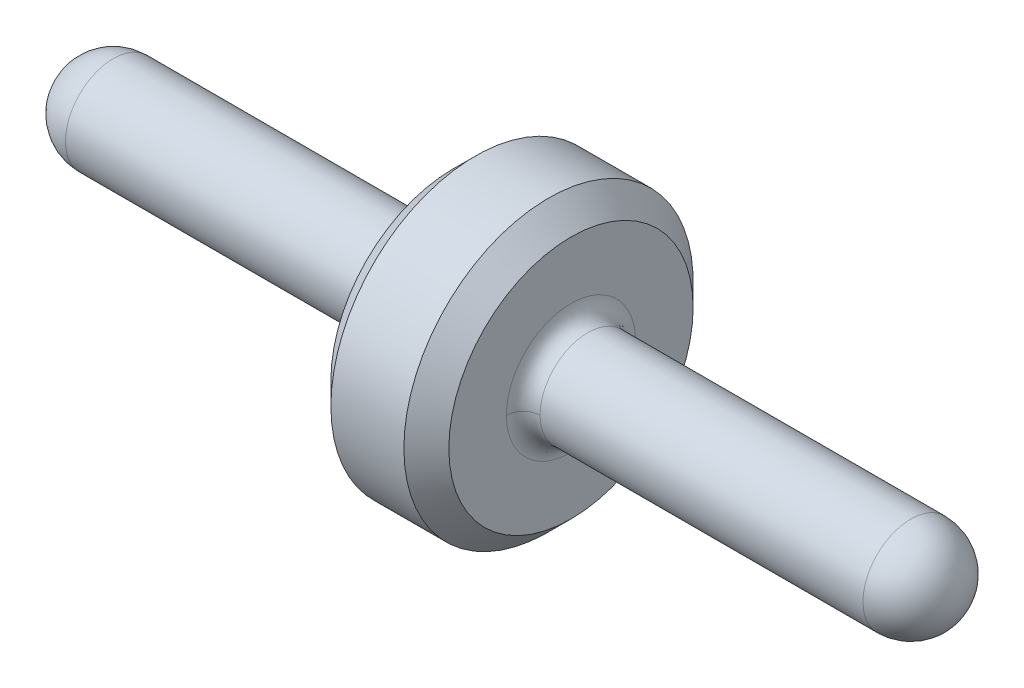
ISO-10303-21;
HEADER;
FILE_DESCRIPTION(('STEP AP214'),'2;1');
FILE_NAME('part.step','',(''),(''),'','','');
FILE_SCHEMA(('AUTOMOTIVE_DESIGN { 1 0 10303 214 1 1 1 1 }'));
ENDSEC;
DATA;
#1=APPLICATION_CONTEXT('core data for automotive mechanical design processes');
#2=APPLICATION_PROTOCOL_DEFINITION('international standard','automotive_design',2000,#1);
#3=PRODUCT_CONTEXT('',#1,'mechanical');
#4=PRODUCT('Part','Part','',(#3));
#5=PRODUCT_RELATED_PRODUCT_CATEGORY('part','',(#4));
#6=PRODUCT_DEFINITION_FORMATION('','',#4);
#7=PRODUCT_DEFINITION_CONTEXT('part definition',#1,'design');
#8=PRODUCT_DEFINITION('design','',#6,#7);
#9=PRODUCT_DEFINITION_SHAPE('','',#8);
#10=(LENGTH_UNIT() NAMED_UNIT(*) SI_UNIT(.MILLI.,.METRE.));
#11=(NAMED_UNIT(*) PLANE_ANGLE_UNIT() SI_UNIT($,.RADIAN.));
#12=(NAMED_UNIT(*) SI_UNIT($,.STERADIAN.) SOLID_ANGLE_UNIT());
#13=UNCERTAINTY_MEASURE_WITH_UNIT(LENGTH_MEASURE(1.E-05),#10,'distance_accuracy_value','');
#14=(GEOMETRIC_REPRESENTATION_CONTEXT(3) GLOBAL_UNCERTAINTY_ASSIGNED_CONTEXT((#13)) GLOBAL_UNIT_ASSIGNED_CONTEXT((#10,
#11,#12)) REPRESENTATION_CONTEXT('',''));
#15=CARTESIAN_POINT('',(0.,0.,0.));
#16=DIRECTION('',(0.,0.,1.));
#17=DIRECTION('',(1.,0.,0.));
#18=AXIS2_PLACEMENT_3D('',#15,#16,#17);
#19=CARTESIAN_POINT('',(3.8227,0.,0.));
#20=DIRECTION('',(-1.,0.,0.));
#21=DIRECTION('',(0.,-1.,0.));
#22=AXIS2_PLACEMENT_3D('',#19,#20,#21);
#23=SPHERICAL_SURFACE('',#22,0.2159);
#24=CARTESIAN_POINT('',(4.0386,2.159E-09,0.));
#25=VERTEX_POINT('',#24);
#26=VERTEX_LOOP('',#25);
#27=FACE_BOUND('',#26,.T.);
#28=CARTESIAN_POINT('',(3.8227,0.,0.));
#29=DIRECTION('',(-1.,0.,0.));
#30=DIRECTION('',(0.,0.,1.));
#31=AXIS2_PLACEMENT_3D('',#28,#29,#30);
#32=CIRCLE('',#31,0.2159);
#33=CARTESIAN_POINT('',(3.8227,0.,0.2159));
#34=VERTEX_POINT('',#33);
#35=EDGE_CURVE('E87',#34,#34,#32,.F.);
#36=ORIENTED_EDGE('',*,*,#35,.T.);
#37=EDGE_LOOP('',(#36));
#38=FACE_BOUND('',#37,.T.);
#39=ADVANCED_FACE('F17',(#27,#38),#23,.T.);
#40=CARTESIAN_POINT('',(3.8227,0.,0.));
#41=DIRECTION('',(-1.,0.,0.));
#42=DIRECTION('',(0.,0.,1.));
#43=AXIS2_PLACEMENT_3D('',#40,#41,#42);
#44=CYLINDRICAL_SURFACE('',#43,0.2159);
#45=CARTESIAN_POINT('',(2.3622,0.,0.));
#46=DIRECTION('',(-1.,0.,0.));
#47=DIRECTION('',(0.,0.,1.));
#48=AXIS2_PLACEMENT_3D('',#45,#46,#47);
#49=CIRCLE('',#48,0.2159);
#50=CARTESIAN_POINT('',(2.36219999777847,-4.428183021646E-11,-0.215900005892549));
#51=VERTEX_POINT('',#50);
#52=CARTESIAN_POINT('',(2.3622,-1.93864443777635E-11,0.2159));
#53=VERTEX_POINT('',#52);
#54=EDGE_CURVE('E22',#51,#53,#49,.F.);
#55=ORIENTED_EDGE('',*,*,#54,.T.);
#56=CARTESIAN_POINT('',(2.3622,0.,0.));
#57=DIRECTION('',(-1.,0.,0.));
#58=DIRECTION('',(0.,0.,1.));
#59=AXIS2_PLACEMENT_3D('',#56,#57,#58);
#60=CIRCLE('',#59,0.2159);
#61=EDGE_CURVE('E75',#51,#53,#60,.T.);
#62=ORIENTED_EDGE('',*,*,#61,.F.);
#63=EDGE_LOOP('',(#55,#62));
#64=FACE_BOUND('',#63,.T.);
#65=ORIENTED_EDGE('',*,*,#35,.F.);
#66=EDGE_LOOP('',(#65));
#67=FACE_BOUND('',#66,.T.);
#68=ADVANCED_FACE('F89',(#64,#67),#44,.T.);
#69=CARTESIAN_POINT('',(2.3698073,0.,-0.2162806952));
#70=CARTESIAN_POINT('',(2.3698073,-0.432561365,-0.2162806952));
#71=CARTESIAN_POINT('',(2.3698073,-0.432561365,0.2162806952));
#72=CARTESIAN_POINT('',(2.3698073,0.,0.2162806952));
#73=CARTESIAN_POINT('',(2.3179999106,0.,-0.2110826106));
#74=CARTESIAN_POINT('',(2.3179999106,-0.4221651958,-0.2110826106));
#75=CARTESIAN_POINT('',(2.3179999106,-0.4221651958,0.2110826106));
#76=CARTESIAN_POINT('',(2.3179999106,0.,0.2110826106));
#77=CARTESIAN_POINT('',(2.2811826106,0.,-0.2478999106));
#78=CARTESIAN_POINT('',(2.2811826106,-0.4957997958,-0.2478999106));
#79=CARTESIAN_POINT('',(2.2811826106,-0.4957997958,0.2478999106));
#80=CARTESIAN_POINT('',(2.2811826106,0.,0.2478999106));
#81=CARTESIAN_POINT('',(2.2863806952,0.,-0.2997073));
#82=CARTESIAN_POINT('',(2.2863806952,-0.5994146,-0.2997073));
#83=CARTESIAN_POINT('',(2.2863806952,-0.5994146,0.2997073));
#84=CARTESIAN_POINT('',(2.2863806952,0.,0.2997073));
#85=(BOUNDED_SURFACE() B_SPLINE_SURFACE(3,3,((#69,#70,#71,#72),(#73,#74,#75,#76),(#77,#78,#79,
#80),(#81,#82,#83,#84)),.UNSPECIFIED.,.F.,.F.,.F.) B_SPLINE_SURFACE_WITH_KNOTS((4,4),(4,4),(0.,
1.),(0.,1.),.UNSPECIFIED.) GEOMETRIC_REPRESENTATION_ITEM() RATIONAL_B_SPLINE_SURFACE(((1.,
0.333333333333333,0.333333333333333,1.),(0.755320871117973,0.251773623705991,0.251773623705991,
0.755320871117973),(0.755320871117973,0.251773623705991,0.251773623705991,0.755320871117973),
(1.,0.333333333333333,0.333333333333333,1.))) REPRESENTATION_ITEM('') SURFACE());
#86=CARTESIAN_POINT('',(2.3698073,0.,-0.2162806952));
#87=CARTESIAN_POINT('',(2.3179999106,0.,-0.2110826106));
#88=CARTESIAN_POINT('',(2.2811826106,0.,-0.2478999106));
#89=CARTESIAN_POINT('',(2.2863806952,0.,-0.2997073));
#90=(BOUNDED_CURVE() B_SPLINE_CURVE(3,(#86,#87,#88,#89),.UNSPECIFIED.,.F.,
.F.) B_SPLINE_CURVE_WITH_KNOTS((4,4),(0.,1.),
.UNSPECIFIED.) CURVE() GEOMETRIC_REPRESENTATION_ITEM() RATIONAL_B_SPLINE_CURVE((1.,
0.755320871117973,0.755320871117973,1.)) REPRESENTATION_ITEM(''));
#91=CARTESIAN_POINT('',(2.28600000707106,0.,-0.29209999924224));
#92=VERTEX_POINT('',#91);
#93=EDGE_CURVE('E84',#92,#51,#90,.F.);
#94=CARTESIAN_POINT('',(2.3698073,0.,0.2162806952));
#95=CARTESIAN_POINT('',(2.3179999106,0.,0.2110826106));
#96=CARTESIAN_POINT('',(2.2811826106,0.,0.2478999106));
#97=CARTESIAN_POINT('',(2.2863806952,0.,0.2997073));
#98=(BOUNDED_CURVE() B_SPLINE_CURVE(3,(#94,#95,#96,#97),.UNSPECIFIED.,.F.,
.F.) B_SPLINE_CURVE_WITH_KNOTS((4,4),(0.,1.),
.UNSPECIFIED.) CURVE() GEOMETRIC_REPRESENTATION_ITEM() RATIONAL_B_SPLINE_CURVE((1.,
0.755320871117973,0.755320871117973,1.)) REPRESENTATION_ITEM(''));
#99=CARTESIAN_POINT('',(2.28600000707106,0.,0.29209999924224));
#100=VERTEX_POINT('',#99);
#101=EDGE_CURVE('E81',#53,#100,#98,.T.);
#102=CARTESIAN_POINT('',(2.2860000117851,0.,0.29210000016356));
#103=CARTESIAN_POINT('',(2.2860000117851,-0.584199996761219,0.29210000016356));
#104=CARTESIAN_POINT('',(2.2860000117851,-0.584199996761219,-0.29210000016356));
#105=CARTESIAN_POINT('',(2.2860000117851,0.,-0.29210000016356));
#106=(BOUNDED_CURVE() B_SPLINE_CURVE(3,(#102,#103,#104,#105),.UNSPECIFIED.,.F.,
.F.) B_SPLINE_CURVE_WITH_KNOTS((4,4),(0.,1.),
.UNSPECIFIED.) CURVE() GEOMETRIC_REPRESENTATION_ITEM() RATIONAL_B_SPLINE_CURVE((0.956578326119741,
0.318859442039913,0.318859442039913,0.956578326119741)) REPRESENTATION_ITEM(''));
#107=EDGE_CURVE('E228',#100,#92,#106,.T.);
#108=ORIENTED_EDGE('',*,*,#93,.T.);
#109=ORIENTED_EDGE('',*,*,#61,.T.);
#110=ORIENTED_EDGE('',*,*,#101,.T.);
#111=ORIENTED_EDGE('',*,*,#107,.T.);
#112=EDGE_LOOP('',(#108,#109,#110,#111));
#113=FACE_BOUND('',#112,.T.);
#114=ADVANCED_FACE('F79',(#113),#85,.F.);
#115=CARTESIAN_POINT('',(2.3698073,0.,0.2162806952));
#116=CARTESIAN_POINT('',(2.3698073,0.432561365,0.2162806952));
#117=CARTESIAN_POINT('',(2.3698073,0.432561365,-0.2162806952));
#118=CARTESIAN_POINT('',(2.3698073,0.,-0.2162806952));
#119=CARTESIAN_POINT('',(2.3179999106,0.,0.2110826106));
#120=CARTESIAN_POINT('',(2.3179999106,0.4221651958,0.2110826106));
#121=CARTESIAN_POINT('',(2.3179999106,0.4221651958,-0.2110826106));
#122=CARTESIAN_POINT('',(2.3179999106,0.,-0.2110826106));
#123=CARTESIAN_POINT('',(2.2811826106,0.,0.2478999106));
#124=CARTESIAN_POINT('',(2.2811826106,0.4957997958,0.2478999106));
#125=CARTESIAN_POINT('',(2.2811826106,0.4957997958,-0.2478999106));
#126=CARTESIAN_POINT('',(2.2811826106,0.,-0.2478999106));
#127=CARTESIAN_POINT('',(2.2863806952,0.,0.2997073));
#128=CARTESIAN_POINT('',(2.2863806952,0.5994146,0.2997073));
#129=CARTESIAN_POINT('',(2.2863806952,0.5994146,-0.2997073));
#130=CARTESIAN_POINT('',(2.2863806952,0.,-0.2997073));
#131=(BOUNDED_SURFACE() B_SPLINE_SURFACE(3,3,((#115,#116,#117,#118),(#119,#120,#121,#122),(#123,
#124,#125,#126),(#127,#128,#129,#130)),.UNSPECIFIED.,.F.,.F.,
.F.) B_SPLINE_SURFACE_WITH_KNOTS((4,4),(4,4),(0.,1.),(0.,1.),
.UNSPECIFIED.) GEOMETRIC_REPRESENTATION_ITEM() RATIONAL_B_SPLINE_SURFACE(((1.,0.333333333333333,
0.333333333333333,1.),(0.755320871117973,0.251773623705991,0.251773623705991,0.755320871117973),
(0.755320871117973,0.251773623705991,0.251773623705991,0.755320871117973),(1.,0.333333333333333,
0.333333333333333,1.))) REPRESENTATION_ITEM('') SURFACE());
#132=CARTESIAN_POINT('',(2.2860000117851,0.,-0.292100000163559));
#133=CARTESIAN_POINT('',(2.2860000117851,0.584199996761219,-0.29210000016356));
#134=CARTESIAN_POINT('',(2.2860000117851,0.584199996761219,0.29210000016356));
#135=CARTESIAN_POINT('',(2.2860000117851,0.,0.292100000163559));
#136=(BOUNDED_CURVE() B_SPLINE_CURVE(3,(#132,#133,#134,#135),.UNSPECIFIED.,.F.,
.F.) B_SPLINE_CURVE_WITH_KNOTS((4,4),(0.,1.),
.UNSPECIFIED.) CURVE() GEOMETRIC_REPRESENTATION_ITEM() RATIONAL_B_SPLINE_CURVE((0.95657832611974,
0.318859442039913,0.318859442039913,0.95657832611974)) REPRESENTATION_ITEM(''));
#137=EDGE_CURVE('E95',#92,#100,#136,.T.);
#138=ORIENTED_EDGE('',*,*,#137,.T.);
#139=ORIENTED_EDGE('',*,*,#101,.F.);
#140=ORIENTED_EDGE('',*,*,#54,.F.);
#141=ORIENTED_EDGE('',*,*,#93,.F.);
#142=EDGE_LOOP('',(#138,#139,#140,#141));
#143=FACE_BOUND('',#142,.T.);
#144=ADVANCED_FACE('F93',(#143),#131,.F.);
#145=CARTESIAN_POINT('',(0.2159,0.,0.));
#146=DIRECTION('',(-1.,0.,0.));
#147=DIRECTION('',(0.,-1.,0.));
#148=AXIS2_PLACEMENT_3D('',#145,#146,#147);
#149=SPHERICAL_SURFACE('',#148,0.2159);
#150=CARTESIAN_POINT('',(0.,2.07043632644582E-09,0.));
#151=VERTEX_POINT('',#150);
#152=VERTEX_LOOP('',#151);
#153=FACE_BOUND('',#152,.T.);
#154=CARTESIAN_POINT('',(0.2159,0.,0.));
#155=DIRECTION('',(-1.,0.,0.));
#156=DIRECTION('',(0.,0.,1.));
#157=AXIS2_PLACEMENT_3D('',#154,#155,#156);
#158=CIRCLE('',#157,0.2159);
#159=CARTESIAN_POINT('',(0.2159,0.,0.2159));
#160=VERTEX_POINT('',#159);
#161=EDGE_CURVE('E215',#160,#160,#158,.T.);
#162=ORIENTED_EDGE('',*,*,#161,.T.);
#163=EDGE_LOOP('',(#162));
#164=FACE_BOUND('',#163,.T.);
#165=ADVANCED_FACE('F134',(#153,#164),#149,.T.);
#166=CARTESIAN_POINT('',(2.286,-0.5590794,-0.5590794));
#167=DIRECTION('',(-1.,0.,0.));
#168=DIRECTION('',(0.,0.,1.));
#169=AXIS2_PLACEMENT_3D('',#166,#167,#168);
#170=PLANE('',#169);
#171=ORIENTED_EDGE('',*,*,#107,.F.);
#172=ORIENTED_EDGE('',*,*,#137,.F.);
#173=EDGE_LOOP('',(#171,#172));
#174=FACE_BOUND('',#173,.T.);
#175=CARTESIAN_POINT('',(2.28600000000001,0.,0.));
#176=DIRECTION('',(-1.,0.,0.));
#177=DIRECTION('',(0.,0.,1.));
#178=AXIS2_PLACEMENT_3D('',#175,#176,#177);
#179=CIRCLE('',#178,0.552449999999991);
#180=CARTESIAN_POINT('',(2.28600000000001,0.,0.552449999999991));
#181=VERTEX_POINT('',#180);
#182=EDGE_CURVE('E212',#181,#181,#179,.F.);
#183=ORIENTED_EDGE('',*,*,#182,.T.);
#184=EDGE_LOOP('',(#183));
#185=FACE_BOUND('',#184,.T.);
#186=ADVANCED_FACE('F165',(#174,#185),#170,.F.);
#187=CARTESIAN_POINT('',(1.6764,0.,0.));
#188=DIRECTION('',(-1.,0.,0.));
#189=DIRECTION('',(0.,-1.,0.));
#190=AXIS2_PLACEMENT_3D('',#187,#188,#189);
#191=CYLINDRICAL_SURFACE('',#190,0.2159);
#192=ORIENTED_EDGE('',*,*,#161,.F.);
#193=EDGE_LOOP('',(#192));
#194=FACE_BOUND('',#193,.T.);
#195=CARTESIAN_POINT('',(1.6764,0.,0.));
#196=DIRECTION('',(-1.,0.,0.));
#197=DIRECTION('',(0.,-1.,0.));
#198=AXIS2_PLACEMENT_3D('',#195,#196,#197);
#199=CIRCLE('',#198,0.2159);
#200=CARTESIAN_POINT('',(1.67640000222154,-1.93864443777635E-11,0.215900005892549));
#201=VERTEX_POINT('',#200);
#202=CARTESIAN_POINT('',(1.6764,-4.428183021646E-11,-0.2159));
#203=VERTEX_POINT('',#202);
#204=EDGE_CURVE('E207',#201,#203,#199,.T.);
#205=ORIENTED_EDGE('',*,*,#204,.T.);
#206=CARTESIAN_POINT('',(1.6764,0.,0.));
#207=DIRECTION('',(-1.,0.,0.));
#208=DIRECTION('',(0.,0.,1.));
#209=AXIS2_PLACEMENT_3D('',#206,#207,#208);
#210=CIRCLE('',#209,0.2159);
#211=EDGE_CURVE('E104',#201,#203,#210,.F.);
#212=ORIENTED_EDGE('',*,*,#211,.F.);
#213=EDGE_LOOP('',(#205,#212));
#214=FACE_BOUND('',#213,.T.);
#215=ADVANCED_FACE('F168',(#194,#214),#191,.T.);
#216=CARTESIAN_POINT('',(2.286,0.,0.));
#217=DIRECTION('',(-1.,0.,0.));
#218=DIRECTION('',(0.,0.,1.));
#219=AXIS2_PLACEMENT_3D('',#216,#217,#218);
#220=CONICAL_SURFACE('',#219,0.55245,0.785398163397449);
#221=ORIENTED_EDGE('',*,*,#182,.F.);
#222=EDGE_LOOP('',(#221));
#223=FACE_BOUND('',#222,.T.);
#224=CARTESIAN_POINT('',(2.1844,0.,0.));
#225=DIRECTION('',(-1.,0.,0.));
#226=DIRECTION('',(0.,0.,1.));
#227=AXIS2_PLACEMENT_3D('',#224,#225,#226);
#228=CIRCLE('',#227,0.65405);
#229=CARTESIAN_POINT('',(2.1844,0.,0.65405));
#230=VERTEX_POINT('',#229);
#231=EDGE_CURVE('E233',#230,#230,#228,.F.);
#232=ORIENTED_EDGE('',*,*,#231,.T.);
#233=EDGE_LOOP('',(#232));
#234=FACE_BOUND('',#233,.T.);
#235=ADVANCED_FACE('F285',(#223,#234),#220,.T.);
#236=CARTESIAN_POINT('',(1.7522193048,0.,-0.2997073));
#237=CARTESIAN_POINT('',(1.7522193048,-0.5994146,-0.2997073));
#238=CARTESIAN_POINT('',(1.7522193048,-0.5994146,0.2997073));
#239=CARTESIAN_POINT('',(1.7522193048,0.,0.2997073));
#240=CARTESIAN_POINT('',(1.7574173894,0.,-0.2478999106));
#241=CARTESIAN_POINT('',(1.7574173894,-0.4957997958,-0.2478999106));
#242=CARTESIAN_POINT('',(1.7574173894,-0.4957997958,0.2478999106));
#243=CARTESIAN_POINT('',(1.7574173894,0.,0.2478999106));
#244=CARTESIAN_POINT('',(1.7206000894,0.,-0.2110826106));
#245=CARTESIAN_POINT('',(1.7206000894,-0.4221651958,-0.2110826106));
#246=CARTESIAN_POINT('',(1.7206000894,-0.4221651958,0.2110826106));
#247=CARTESIAN_POINT('',(1.7206000894,0.,0.2110826106));
#248=CARTESIAN_POINT('',(1.6687927,0.,-0.2162806952));
#249=CARTESIAN_POINT('',(1.6687927,-0.432561365,-0.2162806952));
#250=CARTESIAN_POINT('',(1.6687927,-0.432561365,0.2162806952));
#251=CARTESIAN_POINT('',(1.6687927,0.,0.2162806952));
#252=(BOUNDED_SURFACE() B_SPLINE_SURFACE(3,3,((#236,#237,#238,#239),(#240,#241,#242,#243),(#244,
#245,#246,#247),(#248,#249,#250,#251)),.UNSPECIFIED.,.F.,.F.,
.F.) B_SPLINE_SURFACE_WITH_KNOTS((4,4),(4,4),(0.,1.),(0.,1.),
.UNSPECIFIED.) GEOMETRIC_REPRESENTATION_ITEM() RATIONAL_B_SPLINE_SURFACE(((1.,0.333333333333333,
0.333333333333333,1.),(0.755320871117972,0.251773623705991,0.251773623705991,0.755320871117972),
(0.755320871117972,0.251773623705991,0.251773623705991,0.755320871117972),(1.,0.333333333333333,
0.333333333333333,1.))) REPRESENTATION_ITEM('') SURFACE());
#253=CARTESIAN_POINT('',(1.7522193048,0.,-0.2997073));
#254=CARTESIAN_POINT('',(1.7574173894,0.,-0.2478999106));
#255=CARTESIAN_POINT('',(1.7206000894,0.,-0.2110826106));
#256=CARTESIAN_POINT('',(1.6687927,0.,-0.2162806952));
#257=(BOUNDED_CURVE() B_SPLINE_CURVE(3,(#253,#254,#255,#256),.UNSPECIFIED.,.F.,
.F.) B_SPLINE_CURVE_WITH_KNOTS((4,4),(0.,1.),
.UNSPECIFIED.) CURVE() GEOMETRIC_REPRESENTATION_ITEM() RATIONAL_B_SPLINE_CURVE((1.,
0.755320871117972,0.755320871117972,1.)) REPRESENTATION_ITEM(''));
#258=CARTESIAN_POINT('',(1.75259999292894,0.,-0.29209999924224));
#259=VERTEX_POINT('',#258);
#260=EDGE_CURVE('E210',#203,#259,#257,.F.);
#261=CARTESIAN_POINT('',(1.7525999882149,0.,-0.29210000016356));
#262=CARTESIAN_POINT('',(1.7525999882149,-0.584199996761219,-0.29210000016356));
#263=CARTESIAN_POINT('',(1.7525999882149,-0.584199996761219,0.29210000016356));
#264=CARTESIAN_POINT('',(1.7525999882149,0.,0.29210000016356));
#265=(BOUNDED_CURVE() B_SPLINE_CURVE(3,(#261,#262,#263,#264),.UNSPECIFIED.,.F.,
.F.) B_SPLINE_CURVE_WITH_KNOTS((4,4),(0.,1.),
.UNSPECIFIED.) CURVE() GEOMETRIC_REPRESENTATION_ITEM() RATIONAL_B_SPLINE_CURVE((0.956578326119741,
0.318859442039913,0.318859442039913,0.956578326119741)) REPRESENTATION_ITEM(''));
#266=CARTESIAN_POINT('',(1.75259999292894,0.,0.29209999924224));
#267=VERTEX_POINT('',#266);
#268=EDGE_CURVE('E42',#259,#267,#265,.T.);
#269=CARTESIAN_POINT('',(1.7522193048,0.,0.2997073));
#270=CARTESIAN_POINT('',(1.7574173894,0.,0.2478999106));
#271=CARTESIAN_POINT('',(1.7206000894,0.,0.2110826106));
#272=CARTESIAN_POINT('',(1.6687927,0.,0.2162806952));
#273=(BOUNDED_CURVE() B_SPLINE_CURVE(3,(#269,#270,#271,#272),.UNSPECIFIED.,.F.,
.F.) B_SPLINE_CURVE_WITH_KNOTS((4,4),(0.,1.),
.UNSPECIFIED.) CURVE() GEOMETRIC_REPRESENTATION_ITEM() RATIONAL_B_SPLINE_CURVE((1.,
0.755320871117972,0.755320871117972,1.)) REPRESENTATION_ITEM(''));
#274=EDGE_CURVE('E211',#267,#201,#273,.T.);
#275=ORIENTED_EDGE('',*,*,#260,.T.);
#276=ORIENTED_EDGE('',*,*,#268,.T.);
#277=ORIENTED_EDGE('',*,*,#274,.T.);
#278=ORIENTED_EDGE('',*,*,#211,.T.);
#279=EDGE_LOOP('',(#275,#276,#277,#278));
#280=FACE_BOUND('',#279,.T.);
#281=ADVANCED_FACE('F273',(#280),#252,.F.);
#282=CARTESIAN_POINT('',(1.7522193048,0.,0.2997073));
#283=CARTESIAN_POINT('',(1.7522193048,0.5994146,0.2997073));
#284=CARTESIAN_POINT('',(1.7522193048,0.5994146,-0.2997073));
#285=CARTESIAN_POINT('',(1.7522193048,0.,-0.2997073));
#286=CARTESIAN_POINT('',(1.7574173894,0.,0.2478999106));
#287=CARTESIAN_POINT('',(1.7574173894,0.4957997958,0.2478999106));
#288=CARTESIAN_POINT('',(1.7574173894,0.4957997958,-0.2478999106));
#289=CARTESIAN_POINT('',(1.7574173894,0.,-0.2478999106));
#290=CARTESIAN_POINT('',(1.7206000894,0.,0.2110826106));
#291=CARTESIAN_POINT('',(1.7206000894,0.4221651958,0.2110826106));
#292=CARTESIAN_POINT('',(1.7206000894,0.4221651958,-0.2110826106));
#293=CARTESIAN_POINT('',(1.7206000894,0.,-0.2110826106));
#294=CARTESIAN_POINT('',(1.6687927,0.,0.2162806952));
#295=CARTESIAN_POINT('',(1.6687927,0.432561365,0.2162806952));
#296=CARTESIAN_POINT('',(1.6687927,0.432561365,-0.2162806952));
#297=CARTESIAN_POINT('',(1.6687927,0.,-0.2162806952));
#298=(BOUNDED_SURFACE() B_SPLINE_SURFACE(3,3,((#282,#283,#284,#285),(#286,#287,#288,#289),(#290,
#291,#292,#293),(#294,#295,#296,#297)),.UNSPECIFIED.,.F.,.F.,
.F.) B_SPLINE_SURFACE_WITH_KNOTS((4,4),(4,4),(0.,1.),(0.,1.),
.UNSPECIFIED.) GEOMETRIC_REPRESENTATION_ITEM() RATIONAL_B_SPLINE_SURFACE(((1.,0.333333333333333,
0.333333333333333,1.),(0.755320871117972,0.251773623705991,0.251773623705991,0.755320871117972),
(0.755320871117972,0.251773623705991,0.251773623705991,0.755320871117972),(1.,0.333333333333333,
0.333333333333333,1.))) REPRESENTATION_ITEM('') SURFACE());
#299=CARTESIAN_POINT('',(1.7525999882149,0.,0.292100000163559));
#300=CARTESIAN_POINT('',(1.7525999882149,0.584199996761219,0.292100000163559));
#301=CARTESIAN_POINT('',(1.7525999882149,0.584199996761219,-0.292100000163559));
#302=CARTESIAN_POINT('',(1.7525999882149,0.,-0.292100000163559));
#303=(BOUNDED_CURVE() B_SPLINE_CURVE(3,(#299,#300,#301,#302),.UNSPECIFIED.,.F.,
.F.) B_SPLINE_CURVE_WITH_KNOTS((4,4),(0.,1.),
.UNSPECIFIED.) CURVE() GEOMETRIC_REPRESENTATION_ITEM() RATIONAL_B_SPLINE_CURVE((0.95657832611974,
0.318859442039913,0.318859442039913,0.95657832611974)) REPRESENTATION_ITEM(''));
#304=EDGE_CURVE('E198',#267,#259,#303,.T.);
#305=ORIENTED_EDGE('',*,*,#204,.F.);
#306=ORIENTED_EDGE('',*,*,#274,.F.);
#307=ORIENTED_EDGE('',*,*,#304,.T.);
#308=ORIENTED_EDGE('',*,*,#260,.F.);
#309=EDGE_LOOP('',(#305,#306,#307,#308));
#310=FACE_BOUND('',#309,.T.);
#311=ADVANCED_FACE('F260',(#310),#298,.F.);
#312=CARTESIAN_POINT('',(2.1844,0.,0.));
#313=DIRECTION('',(-1.,0.,0.));
#314=DIRECTION('',(0.,-1.,0.));
#315=AXIS2_PLACEMENT_3D('',#312,#313,#314);
#316=CYLINDRICAL_SURFACE('',#315,0.65405);
#317=ORIENTED_EDGE('',*,*,#231,.F.);
#318=EDGE_LOOP('',(#317));
#319=FACE_BOUND('',#318,.T.);
#320=CARTESIAN_POINT('',(1.85420000000003,0.,0.));
#321=DIRECTION('',(1.,0.,0.));
#322=DIRECTION('',(0.,0.,-1.));
#323=AXIS2_PLACEMENT_3D('',#320,#321,#322);
#324=CIRCLE('',#323,0.65405);
#325=CARTESIAN_POINT('',(1.8542,0.,-0.65405));
#326=VERTEX_POINT('',#325);
#327=EDGE_CURVE('E29',#326,#326,#324,.T.);
#328=ORIENTED_EDGE('',*,*,#327,.T.);
#329=EDGE_LOOP('',(#328));
#330=FACE_BOUND('',#329,.T.);
#331=ADVANCED_FACE('F272',(#319,#330),#316,.T.);
#332=CARTESIAN_POINT('',(1.7526,-0.5590794,0.5590794));
#333=DIRECTION('',(1.,0.,0.));
#334=DIRECTION('',(0.,0.,-1.));
#335=AXIS2_PLACEMENT_3D('',#332,#333,#334);
#336=PLANE('',#335);
#337=ORIENTED_EDGE('',*,*,#268,.F.);
#338=ORIENTED_EDGE('',*,*,#304,.F.);
#339=EDGE_LOOP('',(#337,#338));
#340=FACE_BOUND('',#339,.T.);
#341=CARTESIAN_POINT('',(1.75259999999999,0.,0.));
#342=DIRECTION('',(1.,0.,0.));
#343=DIRECTION('',(0.,0.,-1.));
#344=AXIS2_PLACEMENT_3D('',#341,#342,#343);
#345=CIRCLE('',#344,0.552449999999993);
#346=CARTESIAN_POINT('',(1.75259999999999,0.,-0.552449999999993));
#347=VERTEX_POINT('',#346);
#348=EDGE_CURVE('E11',#347,#347,#345,.F.);
#349=ORIENTED_EDGE('',*,*,#348,.T.);
#350=EDGE_LOOP('',(#349));
#351=FACE_BOUND('',#350,.T.);
#352=ADVANCED_FACE('F19',(#340,#351),#336,.F.);
#353=CARTESIAN_POINT('',(1.7526,0.,0.));
#354=DIRECTION('',(1.,0.,0.));
#355=DIRECTION('',(0.,0.,-1.));
#356=AXIS2_PLACEMENT_3D('',#353,#354,#355);
#357=CONICAL_SURFACE('',#356,0.55245,0.785398163397449);
#358=ORIENTED_EDGE('',*,*,#348,.F.);
#359=EDGE_LOOP('',(#358));
#360=FACE_BOUND('',#359,.T.);
#361=ORIENTED_EDGE('',*,*,#327,.F.);
#362=EDGE_LOOP('',(#361));
#363=FACE_BOUND('',#362,.T.);
#364=ADVANCED_FACE('F304',(#360,#363),#357,.T.);
#365=CLOSED_SHELL('',(#39,#68,#114,#144,#165,#186,#215,#235,#281,#311,#331,#352,#364));
#366=MANIFOLD_SOLID_BREP('B1',#365);
#367=ADVANCED_BREP_SHAPE_REPRESENTATION('',(#18,#366),#14);
#368=SHAPE_DEFINITION_REPRESENTATION(#9,#367);
ENDSEC;
END-ISO-10303-21;
